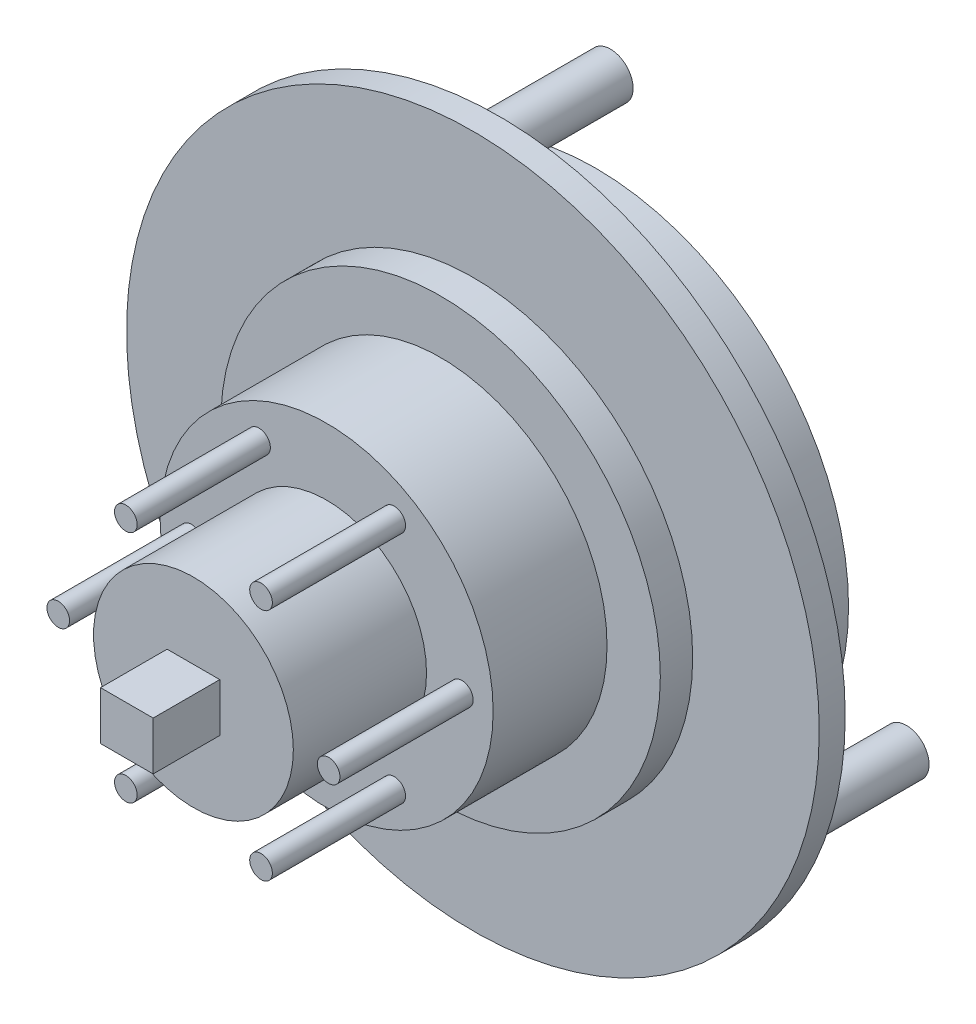
ISO-10303-21;
HEADER;
FILE_DESCRIPTION(('STEP AP214'),'2;1');
FILE_NAME('part.step','',(''),(''),'','','');
FILE_SCHEMA(('AUTOMOTIVE_DESIGN { 1 0 10303 214 1 1 1 1 }'));
ENDSEC;
DATA;
#1=APPLICATION_CONTEXT('core data for automotive mechanical design processes');
#2=APPLICATION_PROTOCOL_DEFINITION('international standard','automotive_design',2000,#1);
#3=PRODUCT_CONTEXT('',#1,'mechanical');
#4=PRODUCT('Part','Part','',(#3));
#5=PRODUCT_RELATED_PRODUCT_CATEGORY('part','',(#4));
#6=PRODUCT_DEFINITION_FORMATION('','',#4);
#7=PRODUCT_DEFINITION_CONTEXT('part definition',#1,'design');
#8=PRODUCT_DEFINITION('design','',#6,#7);
#9=PRODUCT_DEFINITION_SHAPE('','',#8);
#10=(LENGTH_UNIT() NAMED_UNIT(*) SI_UNIT(.MILLI.,.METRE.));
#11=(NAMED_UNIT(*) PLANE_ANGLE_UNIT() SI_UNIT($,.RADIAN.));
#12=(NAMED_UNIT(*) SI_UNIT($,.STERADIAN.) SOLID_ANGLE_UNIT());
#13=UNCERTAINTY_MEASURE_WITH_UNIT(LENGTH_MEASURE(1.E-05),#10,'distance_accuracy_value','');
#14=(GEOMETRIC_REPRESENTATION_CONTEXT(3) GLOBAL_UNCERTAINTY_ASSIGNED_CONTEXT((#13)) GLOBAL_UNIT_ASSIGNED_CONTEXT((#10,
#11,#12)) REPRESENTATION_CONTEXT('',''));
#15=CARTESIAN_POINT('',(0.,0.,0.));
#16=DIRECTION('',(0.,0.,1.));
#17=DIRECTION('',(1.,0.,0.));
#18=AXIS2_PLACEMENT_3D('',#15,#16,#17);
#19=CARTESIAN_POINT('',(0.,0.,22.93));
#20=DIRECTION('',(0.,0.,1.));
#21=DIRECTION('',(1.,0.,0.));
#22=AXIS2_PLACEMENT_3D('',#19,#20,#21);
#23=PLANE('',#22);
#24=CARTESIAN_POINT('',(0.,0.,22.93));
#25=DIRECTION('',(0.,0.,1.));
#26=DIRECTION('',(1.,0.,0.));
#27=AXIS2_PLACEMENT_3D('',#24,#25,#26);
#28=CIRCLE('',#27,7.5);
#29=CARTESIAN_POINT('',(7.5,0.,22.93));
#30=VERTEX_POINT('',#29);
#31=EDGE_CURVE('E156',#30,#30,#28,.T.);
#32=ORIENTED_EDGE('',*,*,#31,.T.);
#33=EDGE_LOOP('',(#32));
#34=FACE_BOUND('',#33,.T.);
#35=DIRECTION('',(1.,0.,0.));
#36=VECTOR('',#35,1.);
#37=CARTESIAN_POINT('',(1.97660852198744,-1.81721212845787,22.93));
#38=LINE('',#37,#36);
#39=CARTESIAN_POINT('',(-1.97660852198744,-1.81721212845787,22.93));
#40=VERTEX_POINT('',#39);
#41=CARTESIAN_POINT('',(1.97660852198744,-1.81721212845787,22.93));
#42=VERTEX_POINT('',#41);
#43=EDGE_CURVE('E89',#40,#42,#38,.T.);
#44=ORIENTED_EDGE('',*,*,#43,.F.);
#45=DIRECTION('',(0.,-1.,0.));
#46=VECTOR('',#45,1.);
#47=CARTESIAN_POINT('',(-1.97660852198744,1.81721212845787,22.93));
#48=LINE('',#47,#46);
#49=CARTESIAN_POINT('',(-1.97660852198744,1.81721212845787,22.93));
#50=VERTEX_POINT('',#49);
#51=EDGE_CURVE('E100',#50,#40,#48,.T.);
#52=ORIENTED_EDGE('',*,*,#51,.F.);
#53=DIRECTION('',(-1.,0.,0.));
#54=VECTOR('',#53,1.);
#55=CARTESIAN_POINT('',(1.97660852198744,1.81721212845787,22.93));
#56=LINE('',#55,#54);
#57=CARTESIAN_POINT('',(1.97660852198744,1.81721212845787,22.93));
#58=VERTEX_POINT('',#57);
#59=EDGE_CURVE('E70',#58,#50,#56,.T.);
#60=ORIENTED_EDGE('',*,*,#59,.F.);
#61=DIRECTION('',(0.,1.,0.));
#62=VECTOR('',#61,1.);
#63=CARTESIAN_POINT('',(1.97660852198744,1.81721212845787,22.93));
#64=LINE('',#63,#62);
#65=EDGE_CURVE('E104',#42,#58,#64,.T.);
#66=ORIENTED_EDGE('',*,*,#65,.F.);
#67=EDGE_LOOP('',(#44,#52,#60,#66));
#68=FACE_BOUND('',#67,.T.);
#69=ADVANCED_FACE('F33',(#34,#68),#23,.T.);
#70=CARTESIAN_POINT('',(0.,0.,12.93));
#71=DIRECTION('',(0.,0.,1.));
#72=DIRECTION('',(1.,0.,0.));
#73=AXIS2_PLACEMENT_3D('',#70,#71,#72);
#74=PLANE('',#73);
#75=CARTESIAN_POINT('',(5.07499999999992,-8.7901578484121,12.93));
#76=DIRECTION('',(0.,0.,1.));
#77=DIRECTION('',(1.,0.,0.));
#78=AXIS2_PLACEMENT_3D('',#75,#76,#77);
#79=CIRCLE('',#78,0.85);
#80=CARTESIAN_POINT('',(5.92499999999992,-8.7901578484121,12.93));
#81=VERTEX_POINT('',#80);
#82=EDGE_CURVE('E114',#81,#81,#79,.T.);
#83=ORIENTED_EDGE('',*,*,#82,.F.);
#84=EDGE_LOOP('',(#83));
#85=FACE_BOUND('',#84,.T.);
#86=CARTESIAN_POINT('',(5.07500000000004,8.79015784841203,12.93));
#87=DIRECTION('',(0.,0.,1.));
#88=DIRECTION('',(1.,0.,0.));
#89=AXIS2_PLACEMENT_3D('',#86,#87,#88);
#90=CIRCLE('',#89,0.85);
#91=CARTESIAN_POINT('',(5.92500000000004,8.79015784841203,12.93));
#92=VERTEX_POINT('',#91);
#93=EDGE_CURVE('E126',#92,#92,#90,.T.);
#94=ORIENTED_EDGE('',*,*,#93,.F.);
#95=EDGE_LOOP('',(#94));
#96=FACE_BOUND('',#95,.T.);
#97=CARTESIAN_POINT('',(-10.15,0.,12.93));
#98=DIRECTION('',(0.,0.,1.));
#99=DIRECTION('',(1.,0.,0.));
#100=AXIS2_PLACEMENT_3D('',#97,#98,#99);
#101=CIRCLE('',#100,0.85);
#102=CARTESIAN_POINT('',(-9.3,0.,12.93));
#103=VERTEX_POINT('',#102);
#104=EDGE_CURVE('E138',#103,#103,#101,.T.);
#105=ORIENTED_EDGE('',*,*,#104,.F.);
#106=EDGE_LOOP('',(#105));
#107=FACE_BOUND('',#106,.T.);
#108=CARTESIAN_POINT('',(0.,0.,12.93));
#109=DIRECTION('',(0.,0.,1.));
#110=DIRECTION('',(1.,0.,0.));
#111=AXIS2_PLACEMENT_3D('',#108,#109,#110);
#112=CIRCLE('',#111,12.5);
#113=CARTESIAN_POINT('',(12.5,0.,12.93));
#114=VERTEX_POINT('',#113);
#115=EDGE_CURVE('E162',#114,#114,#112,.T.);
#116=ORIENTED_EDGE('',*,*,#115,.T.);
#117=EDGE_LOOP('',(#116));
#118=FACE_BOUND('',#117,.T.);
#119=CARTESIAN_POINT('',(0.,0.,12.93));
#120=DIRECTION('',(0.,0.,1.));
#121=DIRECTION('',(1.,0.,0.));
#122=AXIS2_PLACEMENT_3D('',#119,#120,#121);
#123=CIRCLE('',#122,7.5);
#124=CARTESIAN_POINT('',(7.5,0.,12.93));
#125=VERTEX_POINT('',#124);
#126=EDGE_CURVE('E155',#125,#125,#123,.T.);
#127=ORIENTED_EDGE('',*,*,#126,.F.);
#128=EDGE_LOOP('',(#127));
#129=FACE_BOUND('',#128,.T.);
#130=CARTESIAN_POINT('',(-5.07499999999998,8.79015784841206,12.93));
#131=DIRECTION('',(0.,0.,1.));
#132=DIRECTION('',(1.,0.,0.));
#133=AXIS2_PLACEMENT_3D('',#130,#131,#132);
#134=CIRCLE('',#133,0.849999999999999);
#135=CARTESIAN_POINT('',(-4.22499999999998,8.79015784841206,12.93));
#136=VERTEX_POINT('',#135);
#137=EDGE_CURVE('E132',#136,#136,#134,.T.);
#138=ORIENTED_EDGE('',*,*,#137,.F.);
#139=EDGE_LOOP('',(#138));
#140=FACE_BOUND('',#139,.T.);
#141=CARTESIAN_POINT('',(10.15,0.,12.93));
#142=DIRECTION('',(0.,0.,1.));
#143=DIRECTION('',(1.,0.,0.));
#144=AXIS2_PLACEMENT_3D('',#141,#142,#143);
#145=CIRCLE('',#144,0.85);
#146=CARTESIAN_POINT('',(11.,0.,12.93));
#147=VERTEX_POINT('',#146);
#148=EDGE_CURVE('E120',#147,#147,#145,.T.);
#149=ORIENTED_EDGE('',*,*,#148,.F.);
#150=EDGE_LOOP('',(#149));
#151=FACE_BOUND('',#150,.T.);
#152=CARTESIAN_POINT('',(-5.0750000000001,-8.79015784841199,12.93));
#153=DIRECTION('',(0.,0.,1.));
#154=DIRECTION('',(1.,0.,0.));
#155=AXIS2_PLACEMENT_3D('',#152,#153,#154);
#156=CIRCLE('',#155,0.849999999999998);
#157=CARTESIAN_POINT('',(-4.22500000000011,-8.79015784841199,12.93));
#158=VERTEX_POINT('',#157);
#159=EDGE_CURVE('E110',#158,#158,#156,.T.);
#160=ORIENTED_EDGE('',*,*,#159,.F.);
#161=EDGE_LOOP('',(#160));
#162=FACE_BOUND('',#161,.T.);
#163=ADVANCED_FACE('F196',(#85,#96,#107,#118,#129,#140,#151,#162),#74,.T.);
#164=CARTESIAN_POINT('',(0.,0.,0.));
#165=DIRECTION('',(0.,0.,1.));
#166=DIRECTION('',(1.,0.,0.));
#167=AXIS2_PLACEMENT_3D('',#164,#165,#166);
#168=PLANE('',#167);
#169=CARTESIAN_POINT('',(20.5940838374825,-10.0146747772828,0.));
#170=DIRECTION('',(0.,0.,1.));
#171=DIRECTION('',(1.,0.,0.));
#172=AXIS2_PLACEMENT_3D('',#169,#170,#171);
#173=CIRCLE('',#172,1.7);
#174=CARTESIAN_POINT('',(22.2940838374825,-10.0146747772828,0.));
#175=VERTEX_POINT('',#174);
#176=EDGE_CURVE('E41',#175,#175,#173,.F.);
#177=ORIENTED_EDGE('',*,*,#176,.F.);
#178=EDGE_LOOP('',(#177));
#179=FACE_BOUND('',#178,.T.);
#180=CARTESIAN_POINT('',(0.,0.,0.));
#181=DIRECTION('',(0.,0.,1.));
#182=DIRECTION('',(1.,0.,0.));
#183=AXIS2_PLACEMENT_3D('',#180,#181,#182);
#184=CIRCLE('',#183,19.);
#185=CARTESIAN_POINT('',(19.,0.,0.));
#186=VERTEX_POINT('',#185);
#187=EDGE_CURVE('E180',#186,#186,#184,.F.);
#188=ORIENTED_EDGE('',*,*,#187,.F.);
#189=EDGE_LOOP('',(#188));
#190=FACE_BOUND('',#189,.T.);
#191=CARTESIAN_POINT('',(0.,0.,0.));
#192=DIRECTION('',(0.,0.,1.));
#193=DIRECTION('',(1.,0.,0.));
#194=AXIS2_PLACEMENT_3D('',#191,#192,#193);
#195=CIRCLE('',#194,26.);
#196=CARTESIAN_POINT('',(26.,0.,0.));
#197=VERTEX_POINT('',#196);
#198=EDGE_CURVE('E176',#197,#197,#195,.T.);
#199=ORIENTED_EDGE('',*,*,#198,.F.);
#200=EDGE_LOOP('',(#199));
#201=FACE_BOUND('',#200,.T.);
#202=CARTESIAN_POINT('',(-18.9700046865074,-12.8276623822848,0.));
#203=DIRECTION('',(0.,0.,1.));
#204=DIRECTION('',(1.,0.,0.));
#205=AXIS2_PLACEMENT_3D('',#202,#203,#204);
#206=CIRCLE('',#205,1.7);
#207=CARTESIAN_POINT('',(-17.2700046865074,-12.8276623822848,0.));
#208=VERTEX_POINT('',#207);
#209=EDGE_CURVE('E185',#208,#208,#206,.F.);
#210=ORIENTED_EDGE('',*,*,#209,.F.);
#211=EDGE_LOOP('',(#210));
#212=FACE_BOUND('',#211,.T.);
#213=CARTESIAN_POINT('',(-1.62407915097518,22.8423371595677,0.));
#214=DIRECTION('',(0.,0.,1.));
#215=DIRECTION('',(1.,0.,0.));
#216=AXIS2_PLACEMENT_3D('',#213,#214,#215);
#217=CIRCLE('',#216,1.7);
#218=CARTESIAN_POINT('',(0.0759208490248233,22.8423371595677,0.));
#219=VERTEX_POINT('',#218);
#220=EDGE_CURVE('E11',#219,#219,#217,.F.);
#221=ORIENTED_EDGE('',*,*,#220,.F.);
#222=EDGE_LOOP('',(#221));
#223=FACE_BOUND('',#222,.T.);
#224=ADVANCED_FACE('F192',(#179,#190,#201,#212,#223),#168,.F.);
#225=CARTESIAN_POINT('',(0.,0.,4.38));
#226=DIRECTION('',(0.,0.,1.));
#227=DIRECTION('',(1.,0.,0.));
#228=AXIS2_PLACEMENT_3D('',#225,#226,#227);
#229=PLANE('',#228);
#230=CARTESIAN_POINT('',(0.,0.,4.38));
#231=DIRECTION('',(0.,0.,1.));
#232=DIRECTION('',(1.,0.,0.));
#233=AXIS2_PLACEMENT_3D('',#230,#231,#232);
#234=CIRCLE('',#233,16.5);
#235=CARTESIAN_POINT('',(16.5,0.,4.38));
#236=VERTEX_POINT('',#235);
#237=EDGE_CURVE('E168',#236,#236,#234,.T.);
#238=ORIENTED_EDGE('',*,*,#237,.T.);
#239=EDGE_LOOP('',(#238));
#240=FACE_BOUND('',#239,.T.);
#241=CARTESIAN_POINT('',(0.,0.,4.38));
#242=DIRECTION('',(0.,0.,1.));
#243=DIRECTION('',(1.,0.,0.));
#244=AXIS2_PLACEMENT_3D('',#241,#242,#243);
#245=CIRCLE('',#244,12.5);
#246=CARTESIAN_POINT('',(12.5,0.,4.38));
#247=VERTEX_POINT('',#246);
#248=EDGE_CURVE('E159',#247,#247,#245,.T.);
#249=ORIENTED_EDGE('',*,*,#248,.F.);
#250=EDGE_LOOP('',(#249));
#251=FACE_BOUND('',#250,.T.);
#252=ADVANCED_FACE('F195',(#240,#251),#229,.T.);
#253=CARTESIAN_POINT('',(0.,0.,1.95));
#254=DIRECTION('',(0.,0.,1.));
#255=DIRECTION('',(1.,0.,0.));
#256=AXIS2_PLACEMENT_3D('',#253,#254,#255);
#257=PLANE('',#256);
#258=CARTESIAN_POINT('',(0.,0.,1.95));
#259=DIRECTION('',(0.,0.,1.));
#260=DIRECTION('',(1.,0.,0.));
#261=AXIS2_PLACEMENT_3D('',#258,#259,#260);
#262=CIRCLE('',#261,26.);
#263=CARTESIAN_POINT('',(26.,0.,1.95));
#264=VERTEX_POINT('',#263);
#265=EDGE_CURVE('E177',#264,#264,#262,.T.);
#266=ORIENTED_EDGE('',*,*,#265,.T.);
#267=EDGE_LOOP('',(#266));
#268=FACE_BOUND('',#267,.T.);
#269=CARTESIAN_POINT('',(0.,0.,1.95));
#270=DIRECTION('',(0.,0.,1.));
#271=DIRECTION('',(1.,0.,0.));
#272=AXIS2_PLACEMENT_3D('',#269,#270,#271);
#273=CIRCLE('',#272,16.5);
#274=CARTESIAN_POINT('',(16.5,0.,1.95));
#275=VERTEX_POINT('',#274);
#276=EDGE_CURVE('E165',#275,#275,#273,.T.);
#277=ORIENTED_EDGE('',*,*,#276,.F.);
#278=EDGE_LOOP('',(#277));
#279=FACE_BOUND('',#278,.T.);
#280=ADVANCED_FACE('F246',(#268,#279),#257,.T.);
#281=CARTESIAN_POINT('',(0.,0.,1.95));
#282=DIRECTION('',(0.,0.,-1.));
#283=DIRECTION('',(-1.,0.,0.));
#284=AXIS2_PLACEMENT_3D('',#281,#282,#283);
#285=CYLINDRICAL_SURFACE('',#284,26.);
#286=ORIENTED_EDGE('',*,*,#265,.F.);
#287=EDGE_LOOP('',(#286));
#288=FACE_BOUND('',#287,.T.);
#289=ORIENTED_EDGE('',*,*,#198,.T.);
#290=EDGE_LOOP('',(#289));
#291=FACE_BOUND('',#290,.T.);
#292=ADVANCED_FACE('F35',(#288,#291),#285,.T.);
#293=CARTESIAN_POINT('',(0.,0.,-7.25));
#294=DIRECTION('',(0.,0.,1.));
#295=DIRECTION('',(1.,0.,0.));
#296=AXIS2_PLACEMENT_3D('',#293,#294,#295);
#297=CYLINDRICAL_SURFACE('',#296,19.);
#298=CARTESIAN_POINT('',(0.,0.,-7.25));
#299=DIRECTION('',(0.,0.,-1.));
#300=DIRECTION('',(-1.,0.,0.));
#301=AXIS2_PLACEMENT_3D('',#298,#299,#300);
#302=CIRCLE('',#301,19.);
#303=CARTESIAN_POINT('',(-19.,0.,-7.25));
#304=VERTEX_POINT('',#303);
#305=EDGE_CURVE('E171',#304,#304,#302,.T.);
#306=ORIENTED_EDGE('',*,*,#305,.F.);
#307=EDGE_LOOP('',(#306));
#308=FACE_BOUND('',#307,.T.);
#309=ORIENTED_EDGE('',*,*,#187,.T.);
#310=EDGE_LOOP('',(#309));
#311=FACE_BOUND('',#310,.T.);
#312=ADVANCED_FACE('F254',(#308,#311),#297,.T.);
#313=CARTESIAN_POINT('',(0.,0.,-7.25));
#314=DIRECTION('',(0.,0.,-1.));
#315=DIRECTION('',(-1.,0.,0.));
#316=AXIS2_PLACEMENT_3D('',#313,#314,#315);
#317=PLANE('',#316);
#318=ORIENTED_EDGE('',*,*,#305,.T.);
#319=EDGE_LOOP('',(#318));
#320=FACE_BOUND('',#319,.T.);
#321=ADVANCED_FACE('F250',(#320),#317,.T.);
#322=CARTESIAN_POINT('',(0.,0.,4.38));
#323=DIRECTION('',(0.,0.,-1.));
#324=DIRECTION('',(-1.,0.,0.));
#325=AXIS2_PLACEMENT_3D('',#322,#323,#324);
#326=CYLINDRICAL_SURFACE('',#325,16.5);
#327=ORIENTED_EDGE('',*,*,#237,.F.);
#328=EDGE_LOOP('',(#327));
#329=FACE_BOUND('',#328,.T.);
#330=ORIENTED_EDGE('',*,*,#276,.T.);
#331=EDGE_LOOP('',(#330));
#332=FACE_BOUND('',#331,.T.);
#333=ADVANCED_FACE('F242',(#329,#332),#326,.T.);
#334=CARTESIAN_POINT('',(0.,0.,12.93));
#335=DIRECTION('',(0.,0.,-1.));
#336=DIRECTION('',(-1.,0.,0.));
#337=AXIS2_PLACEMENT_3D('',#334,#335,#336);
#338=CYLINDRICAL_SURFACE('',#337,12.5);
#339=ORIENTED_EDGE('',*,*,#115,.F.);
#340=EDGE_LOOP('',(#339));
#341=FACE_BOUND('',#340,.T.);
#342=ORIENTED_EDGE('',*,*,#248,.T.);
#343=EDGE_LOOP('',(#342));
#344=FACE_BOUND('',#343,.T.);
#345=ADVANCED_FACE('F237',(#341,#344),#338,.T.);
#346=CARTESIAN_POINT('',(0.,0.,22.93));
#347=DIRECTION('',(0.,0.,-1.));
#348=DIRECTION('',(-1.,0.,0.));
#349=AXIS2_PLACEMENT_3D('',#346,#347,#348);
#350=CYLINDRICAL_SURFACE('',#349,7.5);
#351=ORIENTED_EDGE('',*,*,#31,.F.);
#352=EDGE_LOOP('',(#351));
#353=FACE_BOUND('',#352,.T.);
#354=ORIENTED_EDGE('',*,*,#126,.T.);
#355=EDGE_LOOP('',(#354));
#356=FACE_BOUND('',#355,.T.);
#357=ADVANCED_FACE('F235',(#353,#356),#350,.T.);
#358=CARTESIAN_POINT('',(-18.9700046865074,-12.8276623822848,-10.));
#359=DIRECTION('',(0.,0.,1.));
#360=DIRECTION('',(1.,0.,0.));
#361=AXIS2_PLACEMENT_3D('',#358,#359,#360);
#362=CYLINDRICAL_SURFACE('',#361,1.7);
#363=CARTESIAN_POINT('',(-18.9700046865074,-12.8276623822848,-10.));
#364=DIRECTION('',(0.,0.,-1.));
#365=DIRECTION('',(-1.,0.,0.));
#366=AXIS2_PLACEMENT_3D('',#363,#364,#365);
#367=CIRCLE('',#366,1.7);
#368=CARTESIAN_POINT('',(-20.6700046865074,-12.8276623822848,-10.));
#369=VERTEX_POINT('',#368);
#370=EDGE_CURVE('E152',#369,#369,#367,.T.);
#371=ORIENTED_EDGE('',*,*,#370,.F.);
#372=EDGE_LOOP('',(#371));
#373=FACE_BOUND('',#372,.T.);
#374=ORIENTED_EDGE('',*,*,#209,.T.);
#375=EDGE_LOOP('',(#374));
#376=FACE_BOUND('',#375,.T.);
#377=ADVANCED_FACE('F233',(#373,#376),#362,.T.);
#378=CARTESIAN_POINT('',(-18.9700046865074,-12.8276623822848,-10.));
#379=DIRECTION('',(0.,0.,-1.));
#380=DIRECTION('',(-1.,0.,0.));
#381=AXIS2_PLACEMENT_3D('',#378,#379,#380);
#382=PLANE('',#381);
#383=ORIENTED_EDGE('',*,*,#370,.T.);
#384=EDGE_LOOP('',(#383));
#385=FACE_BOUND('',#384,.T.);
#386=ADVANCED_FACE('F307',(#385),#382,.T.);
#387=CARTESIAN_POINT('',(20.5940838374825,-10.0146747772828,-10.));
#388=DIRECTION('',(0.,0.,1.));
#389=DIRECTION('',(1.,0.,0.));
#390=AXIS2_PLACEMENT_3D('',#387,#388,#389);
#391=CYLINDRICAL_SURFACE('',#390,1.7);
#392=CARTESIAN_POINT('',(20.5940838374825,-10.0146747772828,-10.));
#393=DIRECTION('',(0.,0.,-1.));
#394=DIRECTION('',(-1.,0.,0.));
#395=AXIS2_PLACEMENT_3D('',#392,#393,#394);
#396=CIRCLE('',#395,1.7);
#397=CARTESIAN_POINT('',(18.8940838374825,-10.0146747772828,-10.));
#398=VERTEX_POINT('',#397);
#399=EDGE_CURVE('E149',#398,#398,#396,.T.);
#400=ORIENTED_EDGE('',*,*,#399,.F.);
#401=EDGE_LOOP('',(#400));
#402=FACE_BOUND('',#401,.T.);
#403=ORIENTED_EDGE('',*,*,#176,.T.);
#404=EDGE_LOOP('',(#403));
#405=FACE_BOUND('',#404,.T.);
#406=ADVANCED_FACE('F190',(#402,#405),#391,.T.);
#407=CARTESIAN_POINT('',(20.5940838374825,-10.0146747772828,-10.));
#408=DIRECTION('',(0.,0.,-1.));
#409=DIRECTION('',(-1.,0.,0.));
#410=AXIS2_PLACEMENT_3D('',#407,#408,#409);
#411=PLANE('',#410);
#412=ORIENTED_EDGE('',*,*,#399,.T.);
#413=EDGE_LOOP('',(#412));
#414=FACE_BOUND('',#413,.T.);
#415=ADVANCED_FACE('F208',(#414),#411,.T.);
#416=CARTESIAN_POINT('',(-1.62407915097518,22.8423371595677,-10.));
#417=DIRECTION('',(0.,0.,1.));
#418=DIRECTION('',(1.,0.,0.));
#419=AXIS2_PLACEMENT_3D('',#416,#417,#418);
#420=CYLINDRICAL_SURFACE('',#419,1.7);
#421=CARTESIAN_POINT('',(-1.62407915097518,22.8423371595677,-10.));
#422=DIRECTION('',(0.,0.,-1.));
#423=DIRECTION('',(-1.,0.,0.));
#424=AXIS2_PLACEMENT_3D('',#421,#422,#423);
#425=CIRCLE('',#424,1.7);
#426=CARTESIAN_POINT('',(-3.32407915097518,22.8423371595677,-10.));
#427=VERTEX_POINT('',#426);
#428=EDGE_CURVE('E144',#427,#427,#425,.T.);
#429=ORIENTED_EDGE('',*,*,#428,.F.);
#430=EDGE_LOOP('',(#429));
#431=FACE_BOUND('',#430,.T.);
#432=ORIENTED_EDGE('',*,*,#220,.T.);
#433=EDGE_LOOP('',(#432));
#434=FACE_BOUND('',#433,.T.);
#435=ADVANCED_FACE('F205',(#431,#434),#420,.T.);
#436=CARTESIAN_POINT('',(-1.62407915097518,22.8423371595677,-10.));
#437=DIRECTION('',(0.,0.,-1.));
#438=DIRECTION('',(-1.,0.,0.));
#439=AXIS2_PLACEMENT_3D('',#436,#437,#438);
#440=PLANE('',#439);
#441=ORIENTED_EDGE('',*,*,#428,.T.);
#442=EDGE_LOOP('',(#441));
#443=FACE_BOUND('',#442,.T.);
#444=ADVANCED_FACE('F207',(#443),#440,.T.);
#445=CARTESIAN_POINT('',(-10.15,0.,22.93));
#446=DIRECTION('',(0.,0.,-1.));
#447=DIRECTION('',(-1.,0.,0.));
#448=AXIS2_PLACEMENT_3D('',#445,#446,#447);
#449=CYLINDRICAL_SURFACE('',#448,0.85);
#450=CARTESIAN_POINT('',(-10.15,0.,22.93));
#451=DIRECTION('',(0.,0.,1.));
#452=DIRECTION('',(1.,0.,0.));
#453=AXIS2_PLACEMENT_3D('',#450,#451,#452);
#454=CIRCLE('',#453,0.85);
#455=CARTESIAN_POINT('',(-9.3,0.,22.93));
#456=VERTEX_POINT('',#455);
#457=EDGE_CURVE('E141',#456,#456,#454,.T.);
#458=ORIENTED_EDGE('',*,*,#457,.F.);
#459=EDGE_LOOP('',(#458));
#460=FACE_BOUND('',#459,.T.);
#461=ORIENTED_EDGE('',*,*,#104,.T.);
#462=EDGE_LOOP('',(#461));
#463=FACE_BOUND('',#462,.T.);
#464=ADVANCED_FACE('F215',(#460,#463),#449,.T.);
#465=CARTESIAN_POINT('',(-10.15,0.,22.93));
#466=DIRECTION('',(0.,0.,1.));
#467=DIRECTION('',(1.,0.,0.));
#468=AXIS2_PLACEMENT_3D('',#465,#466,#467);
#469=PLANE('',#468);
#470=ORIENTED_EDGE('',*,*,#457,.T.);
#471=EDGE_LOOP('',(#470));
#472=FACE_BOUND('',#471,.T.);
#473=ADVANCED_FACE('F349',(#472),#469,.T.);
#474=CARTESIAN_POINT('',(-5.07499999999998,8.79015784841206,22.93));
#475=DIRECTION('',(0.,0.,-1.));
#476=DIRECTION('',(-1.,0.,0.));
#477=AXIS2_PLACEMENT_3D('',#474,#475,#476);
#478=CYLINDRICAL_SURFACE('',#477,0.849999999999999);
#479=CARTESIAN_POINT('',(-5.07499999999998,8.79015784841206,22.93));
#480=DIRECTION('',(0.,0.,1.));
#481=DIRECTION('',(1.,0.,0.));
#482=AXIS2_PLACEMENT_3D('',#479,#480,#481);
#483=CIRCLE('',#482,0.849999999999999);
#484=CARTESIAN_POINT('',(-4.22499999999998,8.79015784841206,22.93));
#485=VERTEX_POINT('',#484);
#486=EDGE_CURVE('E135',#485,#485,#483,.T.);
#487=ORIENTED_EDGE('',*,*,#486,.F.);
#488=EDGE_LOOP('',(#487));
#489=FACE_BOUND('',#488,.T.);
#490=ORIENTED_EDGE('',*,*,#137,.T.);
#491=EDGE_LOOP('',(#490));
#492=FACE_BOUND('',#491,.T.);
#493=ADVANCED_FACE('F358',(#489,#492),#478,.T.);
#494=CARTESIAN_POINT('',(-5.07499999999998,8.79015784841206,22.93));
#495=DIRECTION('',(0.,0.,1.));
#496=DIRECTION('',(1.,0.,0.));
#497=AXIS2_PLACEMENT_3D('',#494,#495,#496);
#498=PLANE('',#497);
#499=ORIENTED_EDGE('',*,*,#486,.T.);
#500=EDGE_LOOP('',(#499));
#501=FACE_BOUND('',#500,.T.);
#502=ADVANCED_FACE('F367',(#501),#498,.T.);
#503=CARTESIAN_POINT('',(5.07500000000004,8.79015784841203,22.93));
#504=DIRECTION('',(0.,0.,-1.));
#505=DIRECTION('',(-1.,0.,0.));
#506=AXIS2_PLACEMENT_3D('',#503,#504,#505);
#507=CYLINDRICAL_SURFACE('',#506,0.85);
#508=CARTESIAN_POINT('',(5.07500000000004,8.79015784841203,22.93));
#509=DIRECTION('',(0.,0.,1.));
#510=DIRECTION('',(1.,0.,0.));
#511=AXIS2_PLACEMENT_3D('',#508,#509,#510);
#512=CIRCLE('',#511,0.85);
#513=CARTESIAN_POINT('',(5.92500000000004,8.79015784841203,22.93));
#514=VERTEX_POINT('',#513);
#515=EDGE_CURVE('E129',#514,#514,#512,.T.);
#516=ORIENTED_EDGE('',*,*,#515,.F.);
#517=EDGE_LOOP('',(#516));
#518=FACE_BOUND('',#517,.T.);
#519=ORIENTED_EDGE('',*,*,#93,.T.);
#520=EDGE_LOOP('',(#519));
#521=FACE_BOUND('',#520,.T.);
#522=ADVANCED_FACE('F376',(#518,#521),#507,.T.);
#523=CARTESIAN_POINT('',(5.07500000000004,8.79015784841203,22.93));
#524=DIRECTION('',(0.,0.,1.));
#525=DIRECTION('',(1.,0.,0.));
#526=AXIS2_PLACEMENT_3D('',#523,#524,#525);
#527=PLANE('',#526);
#528=ORIENTED_EDGE('',*,*,#515,.T.);
#529=EDGE_LOOP('',(#528));
#530=FACE_BOUND('',#529,.T.);
#531=ADVANCED_FACE('F385',(#530),#527,.T.);
#532=CARTESIAN_POINT('',(10.15,0.,22.93));
#533=DIRECTION('',(0.,0.,-1.));
#534=DIRECTION('',(-1.,0.,0.));
#535=AXIS2_PLACEMENT_3D('',#532,#533,#534);
#536=CYLINDRICAL_SURFACE('',#535,0.85);
#537=CARTESIAN_POINT('',(10.15,0.,22.93));
#538=DIRECTION('',(0.,0.,1.));
#539=DIRECTION('',(1.,0.,0.));
#540=AXIS2_PLACEMENT_3D('',#537,#538,#539);
#541=CIRCLE('',#540,0.85);
#542=CARTESIAN_POINT('',(11.,0.,22.93));
#543=VERTEX_POINT('',#542);
#544=EDGE_CURVE('E123',#543,#543,#541,.T.);
#545=ORIENTED_EDGE('',*,*,#544,.F.);
#546=EDGE_LOOP('',(#545));
#547=FACE_BOUND('',#546,.T.);
#548=ORIENTED_EDGE('',*,*,#148,.T.);
#549=EDGE_LOOP('',(#548));
#550=FACE_BOUND('',#549,.T.);
#551=ADVANCED_FACE('F394',(#547,#550),#536,.T.);
#552=CARTESIAN_POINT('',(10.15,0.,22.93));
#553=DIRECTION('',(0.,0.,1.));
#554=DIRECTION('',(1.,0.,0.));
#555=AXIS2_PLACEMENT_3D('',#552,#553,#554);
#556=PLANE('',#555);
#557=ORIENTED_EDGE('',*,*,#544,.T.);
#558=EDGE_LOOP('',(#557));
#559=FACE_BOUND('',#558,.T.);
#560=ADVANCED_FACE('F403',(#559),#556,.T.);
#561=CARTESIAN_POINT('',(5.07499999999992,-8.7901578484121,22.93));
#562=DIRECTION('',(0.,0.,-1.));
#563=DIRECTION('',(-1.,0.,0.));
#564=AXIS2_PLACEMENT_3D('',#561,#562,#563);
#565=CYLINDRICAL_SURFACE('',#564,0.85);
#566=CARTESIAN_POINT('',(5.07499999999992,-8.7901578484121,22.93));
#567=DIRECTION('',(0.,0.,1.));
#568=DIRECTION('',(1.,0.,0.));
#569=AXIS2_PLACEMENT_3D('',#566,#567,#568);
#570=CIRCLE('',#569,0.85);
#571=CARTESIAN_POINT('',(5.92499999999992,-8.7901578484121,22.93));
#572=VERTEX_POINT('',#571);
#573=EDGE_CURVE('E117',#572,#572,#570,.T.);
#574=ORIENTED_EDGE('',*,*,#573,.F.);
#575=EDGE_LOOP('',(#574));
#576=FACE_BOUND('',#575,.T.);
#577=ORIENTED_EDGE('',*,*,#82,.T.);
#578=EDGE_LOOP('',(#577));
#579=FACE_BOUND('',#578,.T.);
#580=ADVANCED_FACE('F412',(#576,#579),#565,.T.);
#581=CARTESIAN_POINT('',(5.07499999999992,-8.7901578484121,22.93));
#582=DIRECTION('',(0.,0.,1.));
#583=DIRECTION('',(1.,0.,0.));
#584=AXIS2_PLACEMENT_3D('',#581,#582,#583);
#585=PLANE('',#584);
#586=ORIENTED_EDGE('',*,*,#573,.T.);
#587=EDGE_LOOP('',(#586));
#588=FACE_BOUND('',#587,.T.);
#589=ADVANCED_FACE('F421',(#588),#585,.T.);
#590=CARTESIAN_POINT('',(-5.0750000000001,-8.79015784841199,22.93));
#591=DIRECTION('',(0.,0.,-1.));
#592=DIRECTION('',(-1.,0.,0.));
#593=AXIS2_PLACEMENT_3D('',#590,#591,#592);
#594=CYLINDRICAL_SURFACE('',#593,0.849999999999998);
#595=CARTESIAN_POINT('',(-5.0750000000001,-8.79015784841199,22.93));
#596=DIRECTION('',(0.,0.,1.));
#597=DIRECTION('',(1.,0.,0.));
#598=AXIS2_PLACEMENT_3D('',#595,#596,#597);
#599=CIRCLE('',#598,0.849999999999998);
#600=CARTESIAN_POINT('',(-4.22500000000011,-8.79015784841199,22.93));
#601=VERTEX_POINT('',#600);
#602=EDGE_CURVE('E111',#601,#601,#599,.T.);
#603=ORIENTED_EDGE('',*,*,#602,.F.);
#604=EDGE_LOOP('',(#603));
#605=FACE_BOUND('',#604,.T.);
#606=ORIENTED_EDGE('',*,*,#159,.T.);
#607=EDGE_LOOP('',(#606));
#608=FACE_BOUND('',#607,.T.);
#609=ADVANCED_FACE('F430',(#605,#608),#594,.T.);
#610=CARTESIAN_POINT('',(-5.0750000000001,-8.79015784841199,22.93));
#611=DIRECTION('',(0.,0.,1.));
#612=DIRECTION('',(1.,0.,0.));
#613=AXIS2_PLACEMENT_3D('',#610,#611,#612);
#614=PLANE('',#613);
#615=ORIENTED_EDGE('',*,*,#602,.T.);
#616=EDGE_LOOP('',(#615));
#617=FACE_BOUND('',#616,.T.);
#618=ADVANCED_FACE('F439',(#617),#614,.T.);
#619=CARTESIAN_POINT('',(-1.97660852198744,1.81721212845787,27.93));
#620=DIRECTION('',(1.,0.,0.));
#621=DIRECTION('',(0.,0.,-1.));
#622=AXIS2_PLACEMENT_3D('',#619,#620,#621);
#623=PLANE('',#622);
#624=ORIENTED_EDGE('',*,*,#51,.T.);
#625=DIRECTION('',(0.,0.,-1.));
#626=VECTOR('',#625,1.);
#627=CARTESIAN_POINT('',(-1.97660852198744,-1.81721212845787,27.93));
#628=LINE('',#627,#626);
#629=CARTESIAN_POINT('',(-1.97660852198744,-1.81721212845787,27.93));
#630=VERTEX_POINT('',#629);
#631=EDGE_CURVE('E92',#630,#40,#628,.T.);
#632=ORIENTED_EDGE('',*,*,#631,.F.);
#633=DIRECTION('',(0.,-1.,0.));
#634=VECTOR('',#633,1.);
#635=CARTESIAN_POINT('',(-1.97660852198744,1.81721212845787,27.93));
#636=LINE('',#635,#634);
#637=CARTESIAN_POINT('',(-1.97660852198744,1.81721212845787,27.93));
#638=VERTEX_POINT('',#637);
#639=EDGE_CURVE('E82',#638,#630,#636,.T.);
#640=ORIENTED_EDGE('',*,*,#639,.F.);
#641=DIRECTION('',(0.,0.,-1.));
#642=VECTOR('',#641,1.);
#643=CARTESIAN_POINT('',(-1.97660852198744,1.81721212845787,27.93));
#644=LINE('',#643,#642);
#645=EDGE_CURVE('E96',#638,#50,#644,.T.);
#646=ORIENTED_EDGE('',*,*,#645,.T.);
#647=EDGE_LOOP('',(#624,#632,#640,#646));
#648=FACE_BOUND('',#647,.T.);
#649=ADVANCED_FACE('F448',(#648),#623,.F.);
#650=CARTESIAN_POINT('',(1.97660852198744,-1.81721212845787,27.93));
#651=DIRECTION('',(0.,1.,0.));
#652=DIRECTION('',(0.,0.,1.));
#653=AXIS2_PLACEMENT_3D('',#650,#651,#652);
#654=PLANE('',#653);
#655=ORIENTED_EDGE('',*,*,#43,.T.);
#656=DIRECTION('',(0.,0.,-1.));
#657=VECTOR('',#656,1.);
#658=CARTESIAN_POINT('',(1.97660852198744,-1.81721212845787,27.93));
#659=LINE('',#658,#657);
#660=CARTESIAN_POINT('',(1.97660852198744,-1.81721212845787,27.93));
#661=VERTEX_POINT('',#660);
#662=EDGE_CURVE('E86',#661,#42,#659,.T.);
#663=ORIENTED_EDGE('',*,*,#662,.F.);
#664=DIRECTION('',(1.,0.,0.));
#665=VECTOR('',#664,1.);
#666=CARTESIAN_POINT('',(1.97660852198744,-1.81721212845787,27.93));
#667=LINE('',#666,#665);
#668=EDGE_CURVE('E77',#630,#661,#667,.T.);
#669=ORIENTED_EDGE('',*,*,#668,.F.);
#670=ORIENTED_EDGE('',*,*,#631,.T.);
#671=EDGE_LOOP('',(#655,#663,#669,#670));
#672=FACE_BOUND('',#671,.T.);
#673=ADVANCED_FACE('F87',(#672),#654,.F.);
#674=CARTESIAN_POINT('',(1.97660852198744,1.81721212845787,27.93));
#675=DIRECTION('',(-1.,0.,0.));
#676=DIRECTION('',(0.,0.,1.));
#677=AXIS2_PLACEMENT_3D('',#674,#675,#676);
#678=PLANE('',#677);
#679=ORIENTED_EDGE('',*,*,#65,.T.);
#680=DIRECTION('',(0.,0.,-1.));
#681=VECTOR('',#680,1.);
#682=CARTESIAN_POINT('',(1.97660852198744,1.81721212845787,27.93));
#683=LINE('',#682,#681);
#684=CARTESIAN_POINT('',(1.97660852198744,1.81721212845787,27.93));
#685=VERTEX_POINT('',#684);
#686=EDGE_CURVE('E48',#685,#58,#683,.T.);
#687=ORIENTED_EDGE('',*,*,#686,.F.);
#688=DIRECTION('',(0.,1.,0.));
#689=VECTOR('',#688,1.);
#690=CARTESIAN_POINT('',(1.97660852198744,1.81721212845787,27.93));
#691=LINE('',#690,#689);
#692=EDGE_CURVE('E80',#661,#685,#691,.T.);
#693=ORIENTED_EDGE('',*,*,#692,.F.);
#694=ORIENTED_EDGE('',*,*,#662,.T.);
#695=EDGE_LOOP('',(#679,#687,#693,#694));
#696=FACE_BOUND('',#695,.T.);
#697=ADVANCED_FACE('F94',(#696),#678,.F.);
#698=CARTESIAN_POINT('',(1.97660852198744,1.81721212845787,27.93));
#699=DIRECTION('',(0.,-1.,0.));
#700=DIRECTION('',(0.,0.,-1.));
#701=AXIS2_PLACEMENT_3D('',#698,#699,#700);
#702=PLANE('',#701);
#703=ORIENTED_EDGE('',*,*,#59,.T.);
#704=ORIENTED_EDGE('',*,*,#645,.F.);
#705=DIRECTION('',(-1.,0.,0.));
#706=VECTOR('',#705,1.);
#707=CARTESIAN_POINT('',(1.97660852198744,1.81721212845787,27.93));
#708=LINE('',#707,#706);
#709=EDGE_CURVE('E56',#685,#638,#708,.T.);
#710=ORIENTED_EDGE('',*,*,#709,.F.);
#711=ORIENTED_EDGE('',*,*,#686,.T.);
#712=EDGE_LOOP('',(#703,#704,#710,#711));
#713=FACE_BOUND('',#712,.T.);
#714=ADVANCED_FACE('F476',(#713),#702,.F.);
#715=CARTESIAN_POINT('',(-1.97660852198744,-1.81721212845787,27.93));
#716=DIRECTION('',(0.,0.,-1.));
#717=DIRECTION('',(-1.,0.,0.));
#718=AXIS2_PLACEMENT_3D('',#715,#716,#717);
#719=PLANE('',#718);
#720=ORIENTED_EDGE('',*,*,#639,.T.);
#721=ORIENTED_EDGE('',*,*,#668,.T.);
#722=ORIENTED_EDGE('',*,*,#692,.T.);
#723=ORIENTED_EDGE('',*,*,#709,.T.);
#724=EDGE_LOOP('',(#720,#721,#722,#723));
#725=FACE_BOUND('',#724,.T.);
#726=ADVANCED_FACE('F78',(#725),#719,.F.);
#727=CLOSED_SHELL('',(#69,#163,#224,#252,#280,#292,#312,#321,#333,#345,#357,#377,#386,#406,#415,
#435,#444,#464,#473,#493,#502,#522,#531,#551,#560,#580,#589,#609,#618,#649,#673,#697,#714,#726));
#728=MANIFOLD_SOLID_BREP('B2',#727);
#729=ADVANCED_BREP_SHAPE_REPRESENTATION('',(#18,#728),#14);
#730=SHAPE_DEFINITION_REPRESENTATION(#9,#729);
ENDSEC;
END-ISO-10303-21;
